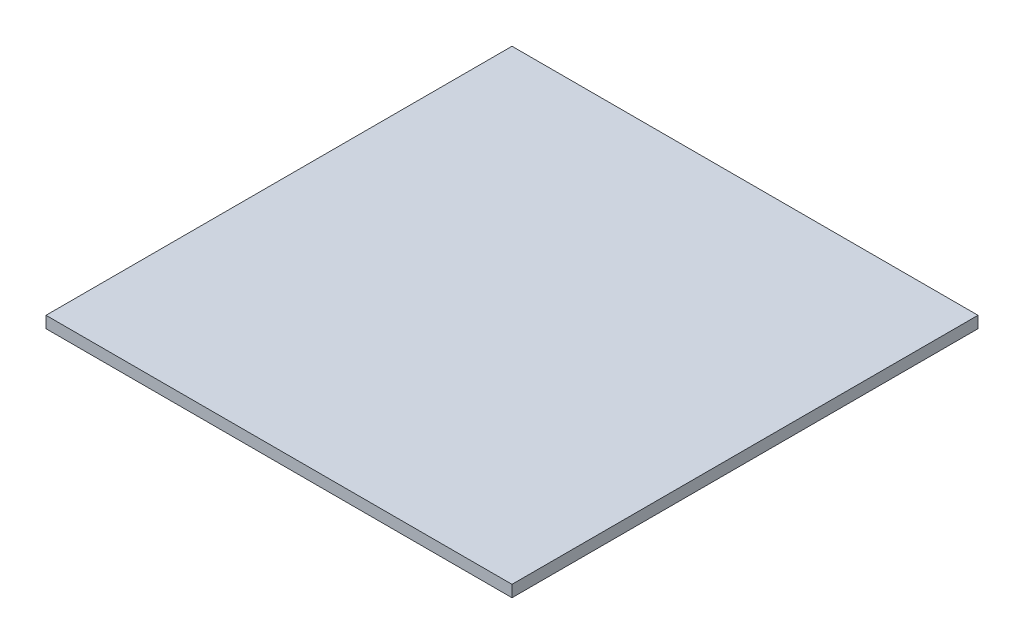
ISO-10303-21;
HEADER;
FILE_DESCRIPTION(('STEP AP214'),'2;1');
FILE_NAME('part.step','',(''),(''),'','','');
FILE_SCHEMA(('AUTOMOTIVE_DESIGN { 1 0 10303 214 1 1 1 1 }'));
ENDSEC;
DATA;
#1=APPLICATION_CONTEXT('core data for automotive mechanical design processes');
#2=APPLICATION_PROTOCOL_DEFINITION('international standard','automotive_design',2000,#1);
#3=PRODUCT_CONTEXT('',#1,'mechanical');
#4=PRODUCT('Part','Part','',(#3));
#5=PRODUCT_RELATED_PRODUCT_CATEGORY('part','',(#4));
#6=PRODUCT_DEFINITION_FORMATION('','',#4);
#7=PRODUCT_DEFINITION_CONTEXT('part definition',#1,'design');
#8=PRODUCT_DEFINITION('design','',#6,#7);
#9=PRODUCT_DEFINITION_SHAPE('','',#8);
#10=(LENGTH_UNIT() NAMED_UNIT(*) SI_UNIT(.MILLI.,.METRE.));
#11=(NAMED_UNIT(*) PLANE_ANGLE_UNIT() SI_UNIT($,.RADIAN.));
#12=(NAMED_UNIT(*) SI_UNIT($,.STERADIAN.) SOLID_ANGLE_UNIT());
#13=UNCERTAINTY_MEASURE_WITH_UNIT(LENGTH_MEASURE(1.E-05),#10,'distance_accuracy_value','');
#14=(GEOMETRIC_REPRESENTATION_CONTEXT(3) GLOBAL_UNCERTAINTY_ASSIGNED_CONTEXT((#13)) GLOBAL_UNIT_ASSIGNED_CONTEXT((#10,
#11,#12)) REPRESENTATION_CONTEXT('',''));
#15=CARTESIAN_POINT('',(0.,0.,0.));
#16=DIRECTION('',(0.,0.,1.));
#17=DIRECTION('',(1.,0.,0.));
#18=AXIS2_PLACEMENT_3D('',#15,#16,#17);
#19=CARTESIAN_POINT('',(0.,10.,0.));
#20=DIRECTION('',(1.,0.,0.));
#21=DIRECTION('',(0.,0.,-1.));
#22=AXIS2_PLACEMENT_3D('',#19,#20,#21);
#23=PLANE('',#22);
#24=DIRECTION('',(0.,0.,1.));
#25=VECTOR('',#24,1.);
#26=CARTESIAN_POINT('',(0.,0.,0.));
#27=LINE('',#26,#25);
#28=CARTESIAN_POINT('',(0.,0.,-400.));
#29=VERTEX_POINT('',#28);
#30=CARTESIAN_POINT('',(0.,0.,0.));
#31=VERTEX_POINT('',#30);
#32=EDGE_CURVE('E93',#29,#31,#27,.T.);
#33=ORIENTED_EDGE('',*,*,#32,.T.);
#34=DIRECTION('',(0.,-1.,0.));
#35=VECTOR('',#34,1.);
#36=CARTESIAN_POINT('',(0.,10.,0.));
#37=LINE('',#36,#35);
#38=CARTESIAN_POINT('',(0.,10.,0.));
#39=VERTEX_POINT('',#38);
#40=EDGE_CURVE('E11',#39,#31,#37,.T.);
#41=ORIENTED_EDGE('',*,*,#40,.F.);
#42=DIRECTION('',(0.,0.,1.));
#43=VECTOR('',#42,1.);
#44=CARTESIAN_POINT('',(0.,10.,0.));
#45=LINE('',#44,#43);
#46=CARTESIAN_POINT('',(0.,10.,-400.));
#47=VERTEX_POINT('',#46);
#48=EDGE_CURVE('E81',#47,#39,#45,.T.);
#49=ORIENTED_EDGE('',*,*,#48,.F.);
#50=DIRECTION('',(0.,-1.,0.));
#51=VECTOR('',#50,1.);
#52=CARTESIAN_POINT('',(0.,10.,-400.));
#53=LINE('',#52,#51);
#54=EDGE_CURVE('E89',#47,#29,#53,.T.);
#55=ORIENTED_EDGE('',*,*,#54,.T.);
#56=EDGE_LOOP('',(#33,#41,#49,#55));
#57=FACE_BOUND('',#56,.T.);
#58=ADVANCED_FACE('F30',(#57),#23,.F.);
#59=CARTESIAN_POINT('',(0.,10.,0.));
#60=DIRECTION('',(0.,0.,-1.));
#61=DIRECTION('',(-1.,0.,0.));
#62=AXIS2_PLACEMENT_3D('',#59,#60,#61);
#63=PLANE('',#62);
#64=DIRECTION('',(1.,0.,0.));
#65=VECTOR('',#64,1.);
#66=CARTESIAN_POINT('',(0.,0.,0.));
#67=LINE('',#66,#65);
#68=CARTESIAN_POINT('',(400.,0.,0.));
#69=VERTEX_POINT('',#68);
#70=EDGE_CURVE('E85',#31,#69,#67,.T.);
#71=ORIENTED_EDGE('',*,*,#70,.T.);
#72=DIRECTION('',(0.,-1.,0.));
#73=VECTOR('',#72,1.);
#74=CARTESIAN_POINT('',(400.,10.,0.));
#75=LINE('',#74,#73);
#76=CARTESIAN_POINT('',(400.,10.,0.));
#77=VERTEX_POINT('',#76);
#78=EDGE_CURVE('E38',#77,#69,#75,.T.);
#79=ORIENTED_EDGE('',*,*,#78,.F.);
#80=DIRECTION('',(1.,0.,0.));
#81=VECTOR('',#80,1.);
#82=CARTESIAN_POINT('',(0.,10.,0.));
#83=LINE('',#82,#81);
#84=EDGE_CURVE('E76',#39,#77,#83,.T.);
#85=ORIENTED_EDGE('',*,*,#84,.F.);
#86=ORIENTED_EDGE('',*,*,#40,.T.);
#87=EDGE_LOOP('',(#71,#79,#85,#86));
#88=FACE_BOUND('',#87,.T.);
#89=ADVANCED_FACE('F84',(#88),#63,.F.);
#90=CARTESIAN_POINT('',(400.,10.,0.));
#91=DIRECTION('',(-1.,0.,0.));
#92=DIRECTION('',(0.,0.,1.));
#93=AXIS2_PLACEMENT_3D('',#90,#91,#92);
#94=PLANE('',#93);
#95=DIRECTION('',(0.,0.,-1.));
#96=VECTOR('',#95,1.);
#97=CARTESIAN_POINT('',(400.,0.,0.));
#98=LINE('',#97,#96);
#99=CARTESIAN_POINT('',(400.,0.,-400.));
#100=VERTEX_POINT('',#99);
#101=EDGE_CURVE('E63',#69,#100,#98,.T.);
#102=ORIENTED_EDGE('',*,*,#101,.T.);
#103=DIRECTION('',(0.,-1.,0.));
#104=VECTOR('',#103,1.);
#105=CARTESIAN_POINT('',(400.,10.,-400.));
#106=LINE('',#105,#104);
#107=CARTESIAN_POINT('',(400.,10.,-400.));
#108=VERTEX_POINT('',#107);
#109=EDGE_CURVE('E86',#108,#100,#106,.T.);
#110=ORIENTED_EDGE('',*,*,#109,.F.);
#111=DIRECTION('',(0.,0.,-1.));
#112=VECTOR('',#111,1.);
#113=CARTESIAN_POINT('',(400.,10.,0.));
#114=LINE('',#113,#112);
#115=EDGE_CURVE('E79',#77,#108,#114,.T.);
#116=ORIENTED_EDGE('',*,*,#115,.F.);
#117=ORIENTED_EDGE('',*,*,#78,.T.);
#118=EDGE_LOOP('',(#102,#110,#116,#117));
#119=FACE_BOUND('',#118,.T.);
#120=ADVANCED_FACE('F87',(#119),#94,.F.);
#121=CARTESIAN_POINT('',(0.,10.,-400.));
#122=DIRECTION('',(0.,0.,1.));
#123=DIRECTION('',(1.,0.,0.));
#124=AXIS2_PLACEMENT_3D('',#121,#122,#123);
#125=PLANE('',#124);
#126=DIRECTION('',(-1.,0.,0.));
#127=VECTOR('',#126,1.);
#128=CARTESIAN_POINT('',(0.,0.,-400.));
#129=LINE('',#128,#127);
#130=EDGE_CURVE('E69',#100,#29,#129,.T.);
#131=ORIENTED_EDGE('',*,*,#130,.T.);
#132=ORIENTED_EDGE('',*,*,#54,.F.);
#133=DIRECTION('',(-1.,0.,0.));
#134=VECTOR('',#133,1.);
#135=CARTESIAN_POINT('',(0.,10.,-400.));
#136=LINE('',#135,#134);
#137=EDGE_CURVE('E46',#108,#47,#136,.T.);
#138=ORIENTED_EDGE('',*,*,#137,.F.);
#139=ORIENTED_EDGE('',*,*,#109,.T.);
#140=EDGE_LOOP('',(#131,#132,#138,#139));
#141=FACE_BOUND('',#140,.T.);
#142=ADVANCED_FACE('F100',(#141),#125,.F.);
#143=CARTESIAN_POINT('',(0.,10.,-400.));
#144=DIRECTION('',(0.,-1.,0.));
#145=DIRECTION('',(0.,0.,-1.));
#146=AXIS2_PLACEMENT_3D('',#143,#144,#145);
#147=PLANE('',#146);
#148=ORIENTED_EDGE('',*,*,#48,.T.);
#149=ORIENTED_EDGE('',*,*,#84,.T.);
#150=ORIENTED_EDGE('',*,*,#115,.T.);
#151=ORIENTED_EDGE('',*,*,#137,.T.);
#152=EDGE_LOOP('',(#148,#149,#150,#151));
#153=FACE_BOUND('',#152,.T.);
#154=ADVANCED_FACE('F77',(#153),#147,.F.);
#155=CARTESIAN_POINT('',(0.,0.,-400.));
#156=DIRECTION('',(0.,-1.,0.));
#157=DIRECTION('',(0.,0.,-1.));
#158=AXIS2_PLACEMENT_3D('',#155,#156,#157);
#159=PLANE('',#158);
#160=ORIENTED_EDGE('',*,*,#32,.F.);
#161=ORIENTED_EDGE('',*,*,#130,.F.);
#162=ORIENTED_EDGE('',*,*,#101,.F.);
#163=ORIENTED_EDGE('',*,*,#70,.F.);
#164=EDGE_LOOP('',(#160,#161,#162,#163));
#165=FACE_BOUND('',#164,.T.);
#166=ADVANCED_FACE('F103',(#165),#159,.T.);
#167=CLOSED_SHELL('',(#58,#89,#120,#142,#154,#166));
#168=MANIFOLD_SOLID_BREP('B2',#167);
#169=ADVANCED_BREP_SHAPE_REPRESENTATION('',(#18,#168),#14);
#170=SHAPE_DEFINITION_REPRESENTATION(#9,#169);
ENDSEC;
END-ISO-10303-21;
